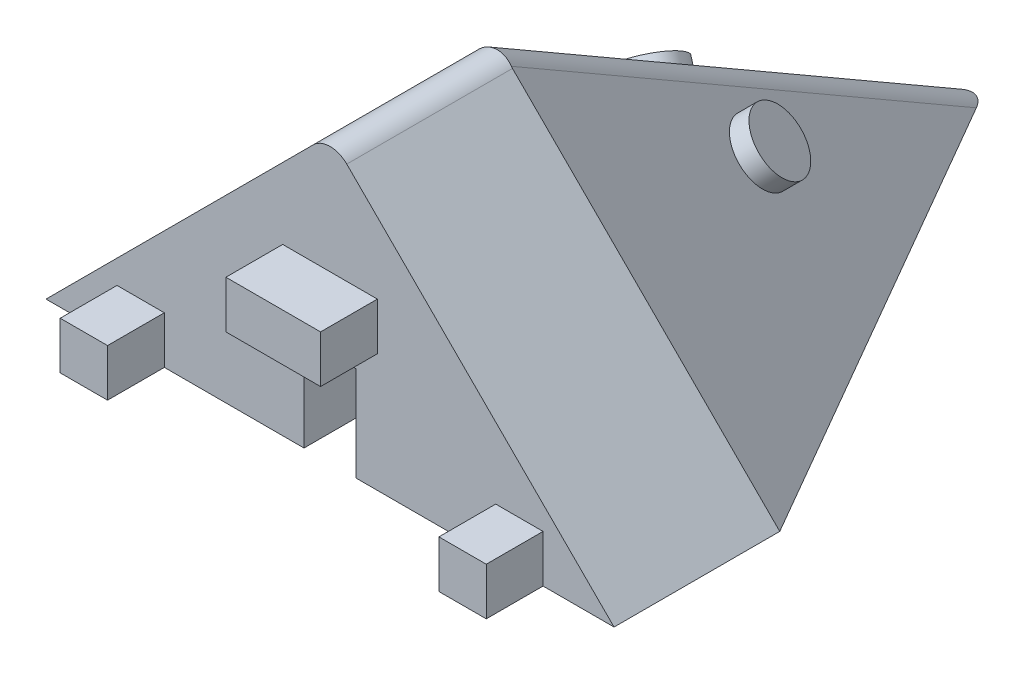
ISO-10303-21;
HEADER;
FILE_DESCRIPTION(('STEP AP214'),'2;1');
FILE_NAME('part.step','',(''),(''),'','','');
FILE_SCHEMA(('AUTOMOTIVE_DESIGN { 1 0 10303 214 1 1 1 1 }'));
ENDSEC;
DATA;
#1=APPLICATION_CONTEXT('core data for automotive mechanical design processes');
#2=APPLICATION_PROTOCOL_DEFINITION('international standard','automotive_design',2000,#1);
#3=PRODUCT_CONTEXT('',#1,'mechanical');
#4=PRODUCT('Part','Part','',(#3));
#5=PRODUCT_RELATED_PRODUCT_CATEGORY('part','',(#4));
#6=PRODUCT_DEFINITION_FORMATION('','',#4);
#7=PRODUCT_DEFINITION_CONTEXT('part definition',#1,'design');
#8=PRODUCT_DEFINITION('design','',#6,#7);
#9=PRODUCT_DEFINITION_SHAPE('','',#8);
#10=(LENGTH_UNIT() NAMED_UNIT(*) SI_UNIT(.MILLI.,.METRE.));
#11=(NAMED_UNIT(*) PLANE_ANGLE_UNIT() SI_UNIT($,.RADIAN.));
#12=(NAMED_UNIT(*) SI_UNIT($,.STERADIAN.) SOLID_ANGLE_UNIT());
#13=UNCERTAINTY_MEASURE_WITH_UNIT(LENGTH_MEASURE(1.E-05),#10,'distance_accuracy_value','');
#14=(GEOMETRIC_REPRESENTATION_CONTEXT(3) GLOBAL_UNCERTAINTY_ASSIGNED_CONTEXT((#13)) GLOBAL_UNIT_ASSIGNED_CONTEXT((#10,
#11,#12)) REPRESENTATION_CONTEXT('',''));
#15=CARTESIAN_POINT('',(0.,0.,0.));
#16=DIRECTION('',(0.,0.,1.));
#17=DIRECTION('',(1.,0.,0.));
#18=AXIS2_PLACEMENT_3D('',#15,#16,#17);
#19=CARTESIAN_POINT('',(0.,0.,17.5));
#20=DIRECTION('',(0.,0.,-1.));
#21=DIRECTION('',(-1.,0.,0.));
#22=AXIS2_PLACEMENT_3D('',#19,#20,#21);
#23=PLANE('',#22);
#24=DIRECTION('',(0.,-1.,0.));
#25=VECTOR('',#24,1.);
#26=CARTESIAN_POINT('',(-35.,17.5,17.5));
#27=LINE('',#26,#25);
#28=CARTESIAN_POINT('',(-35.,17.5,17.5));
#29=VERTEX_POINT('',#28);
#30=CARTESIAN_POINT('',(-35.,12.5,17.5));
#31=VERTEX_POINT('',#30);
#32=EDGE_CURVE('E259',#29,#31,#27,.T.);
#33=ORIENTED_EDGE('',*,*,#32,.F.);
#34=DIRECTION('',(-1.,0.,0.));
#35=VECTOR('',#34,1.);
#36=CARTESIAN_POINT('',(-35.,17.5,17.5));
#37=LINE('',#36,#35);
#38=CARTESIAN_POINT('',(-25.,17.5,17.5));
#39=VERTEX_POINT('',#38);
#40=EDGE_CURVE('E264',#39,#29,#37,.T.);
#41=ORIENTED_EDGE('',*,*,#40,.F.);
#42=DIRECTION('',(0.,1.,0.));
#43=VECTOR('',#42,1.);
#44=CARTESIAN_POINT('',(-25.,17.5,17.5));
#45=LINE('',#44,#43);
#46=CARTESIAN_POINT('',(-25.,12.5,17.5));
#47=VERTEX_POINT('',#46);
#48=EDGE_CURVE('E276',#47,#39,#45,.T.);
#49=ORIENTED_EDGE('',*,*,#48,.F.);
#50=DIRECTION('',(1.,0.,0.));
#51=VECTOR('',#50,1.);
#52=CARTESIAN_POINT('',(-35.,12.5,17.5));
#53=LINE('',#52,#51);
#54=EDGE_CURVE('E273',#31,#47,#53,.T.);
#55=ORIENTED_EDGE('',*,*,#54,.F.);
#56=EDGE_LOOP('',(#33,#41,#49,#55));
#57=FACE_BOUND('',#56,.T.);
#58=DIRECTION('',(-0.707106781186547,0.707106781186547,0.));
#59=VECTOR('',#58,1.);
#60=CARTESIAN_POINT('',(0.,0.,17.5));
#61=LINE('',#60,#59);
#62=CARTESIAN_POINT('',(0.,0.,17.5));
#63=VERTEX_POINT('',#62);
#64=CARTESIAN_POINT('',(-28.2322330470336,28.2322330470336,17.5));
#65=VERTEX_POINT('',#64);
#66=EDGE_CURVE('E307',#63,#65,#61,.T.);
#67=ORIENTED_EDGE('',*,*,#66,.T.);
#68=CARTESIAN_POINT('',(-30.,26.4644660940673,17.5));
#69=DIRECTION('',(0.,0.,-1.));
#70=DIRECTION('',(-1.,0.,0.));
#71=AXIS2_PLACEMENT_3D('',#68,#69,#70);
#72=CIRCLE('',#71,2.5);
#73=CARTESIAN_POINT('',(-31.7677669529664,28.2322330470336,17.5));
#74=VERTEX_POINT('',#73);
#75=EDGE_CURVE('E54',#65,#74,#72,.F.);
#76=ORIENTED_EDGE('',*,*,#75,.T.);
#77=DIRECTION('',(-0.707106781186547,-0.707106781186547,0.));
#78=VECTOR('',#77,1.);
#79=CARTESIAN_POINT('',(-30.,30.,17.5));
#80=LINE('',#79,#78);
#81=CARTESIAN_POINT('',(-60.,0.,17.5));
#82=VERTEX_POINT('',#81);
#83=EDGE_CURVE('E292',#74,#82,#80,.T.);
#84=ORIENTED_EDGE('',*,*,#83,.T.);
#85=DIRECTION('',(1.,0.,0.));
#86=VECTOR('',#85,1.);
#87=CARTESIAN_POINT('',(-60.,0.,17.5));
#88=LINE('',#87,#86);
#89=CARTESIAN_POINT('',(-52.5,0.,17.5));
#90=VERTEX_POINT('',#89);
#91=EDGE_CURVE('E295',#82,#90,#88,.T.);
#92=ORIENTED_EDGE('',*,*,#91,.T.);
#93=DIRECTION('',(0.,-1.,0.));
#94=VECTOR('',#93,1.);
#95=CARTESIAN_POINT('',(-52.5,0.,17.5));
#96=LINE('',#95,#94);
#97=CARTESIAN_POINT('',(-52.5,5.,17.5));
#98=VERTEX_POINT('',#97);
#99=EDGE_CURVE('E237',#98,#90,#96,.T.);
#100=ORIENTED_EDGE('',*,*,#99,.F.);
#101=DIRECTION('',(-1.,0.,0.));
#102=VECTOR('',#101,1.);
#103=CARTESIAN_POINT('',(-47.5,5.,17.5));
#104=LINE('',#103,#102);
#105=CARTESIAN_POINT('',(-47.5,5.,17.5));
#106=VERTEX_POINT('',#105);
#107=EDGE_CURVE('E227',#106,#98,#104,.T.);
#108=ORIENTED_EDGE('',*,*,#107,.F.);
#109=DIRECTION('',(0.,1.,0.));
#110=VECTOR('',#109,1.);
#111=CARTESIAN_POINT('',(-47.5,0.,17.5));
#112=LINE('',#111,#110);
#113=CARTESIAN_POINT('',(-47.5,0.,17.5));
#114=VERTEX_POINT('',#113);
#115=EDGE_CURVE('E224',#114,#106,#112,.T.);
#116=ORIENTED_EDGE('',*,*,#115,.F.);
#117=CARTESIAN_POINT('',(-32.75,0.,17.5));
#118=VERTEX_POINT('',#117);
#119=EDGE_CURVE('E294',#114,#118,#88,.T.);
#120=ORIENTED_EDGE('',*,*,#119,.T.);
#121=DIRECTION('',(0.,1.,0.));
#122=VECTOR('',#121,1.);
#123=CARTESIAN_POINT('',(-32.75,0.,17.5));
#124=LINE('',#123,#122);
#125=CARTESIAN_POINT('',(-32.75,10.,17.5));
#126=VERTEX_POINT('',#125);
#127=EDGE_CURVE('E297',#118,#126,#124,.T.);
#128=ORIENTED_EDGE('',*,*,#127,.T.);
#129=DIRECTION('',(1.,0.,0.));
#130=VECTOR('',#129,1.);
#131=CARTESIAN_POINT('',(-32.75,10.,17.5));
#132=LINE('',#131,#130);
#133=CARTESIAN_POINT('',(-27.25,10.,17.5));
#134=VERTEX_POINT('',#133);
#135=EDGE_CURVE('E299',#126,#134,#132,.T.);
#136=ORIENTED_EDGE('',*,*,#135,.T.);
#137=DIRECTION('',(0.,-1.,0.));
#138=VECTOR('',#137,1.);
#139=CARTESIAN_POINT('',(-27.25,10.,17.5));
#140=LINE('',#139,#138);
#141=CARTESIAN_POINT('',(-27.25,0.,17.5));
#142=VERTEX_POINT('',#141);
#143=EDGE_CURVE('E301',#134,#142,#140,.T.);
#144=ORIENTED_EDGE('',*,*,#143,.T.);
#145=DIRECTION('',(1.,0.,0.));
#146=VECTOR('',#145,1.);
#147=CARTESIAN_POINT('',(-27.25,0.,17.5));
#148=LINE('',#147,#146);
#149=CARTESIAN_POINT('',(-12.5,0.,17.5));
#150=VERTEX_POINT('',#149);
#151=EDGE_CURVE('E305',#142,#150,#148,.T.);
#152=ORIENTED_EDGE('',*,*,#151,.T.);
#153=DIRECTION('',(0.,-1.,0.));
#154=VECTOR('',#153,1.);
#155=CARTESIAN_POINT('',(-12.5,0.,17.5));
#156=LINE('',#155,#154);
#157=CARTESIAN_POINT('',(-12.5,5.,17.5));
#158=VERTEX_POINT('',#157);
#159=EDGE_CURVE('E223',#158,#150,#156,.T.);
#160=ORIENTED_EDGE('',*,*,#159,.F.);
#161=DIRECTION('',(-1.,0.,0.));
#162=VECTOR('',#161,1.);
#163=CARTESIAN_POINT('',(-12.5,5.,17.5));
#164=LINE('',#163,#162);
#165=CARTESIAN_POINT('',(-7.50000000000001,4.99999999999999,17.5));
#166=VERTEX_POINT('',#165);
#167=EDGE_CURVE('E220',#166,#158,#164,.T.);
#168=ORIENTED_EDGE('',*,*,#167,.F.);
#169=DIRECTION('',(0.,1.,0.));
#170=VECTOR('',#169,1.);
#171=CARTESIAN_POINT('',(-7.50000000000001,0.,17.5));
#172=LINE('',#171,#170);
#173=CARTESIAN_POINT('',(-7.50000000000001,0.,17.5));
#174=VERTEX_POINT('',#173);
#175=EDGE_CURVE('E555',#174,#166,#172,.T.);
#176=ORIENTED_EDGE('',*,*,#175,.F.);
#177=EDGE_CURVE('E304',#174,#63,#148,.T.);
#178=ORIENTED_EDGE('',*,*,#177,.T.);
#179=EDGE_LOOP('',(#67,#76,#84,#92,#100,#108,#116,#120,#128,#136,#144,#152,#160,#168,#176,#178));
#180=FACE_BOUND('',#179,.T.);
#181=ADVANCED_FACE('F44',(#57,#180),#23,.F.);
#182=CARTESIAN_POINT('',(0.,0.,0.));
#183=DIRECTION('',(0.,-1.,0.));
#184=DIRECTION('',(0.,0.,-1.));
#185=AXIS2_PLACEMENT_3D('',#182,#183,#184);
#186=PLANE('',#185);
#187=DIRECTION('',(-0.500000000000004,0.,0.866025403784436));
#188=VECTOR('',#187,1.);
#189=CARTESIAN_POINT('',(-60.,0.,0.));
#190=LINE('',#189,#188);
#191=CARTESIAN_POINT('',(-31.6366341767697,0.,-49.126790679497));
#192=VERTEX_POINT('',#191);
#193=CARTESIAN_POINT('',(-60.,0.,0.));
#194=VERTEX_POINT('',#193);
#195=EDGE_CURVE('E390',#192,#194,#190,.T.);
#196=ORIENTED_EDGE('',*,*,#195,.F.);
#197=CARTESIAN_POINT('',(-29.9999999999998,0.,-45.3471459494047));
#198=DIRECTION('',(0.,-1.,0.));
#199=DIRECTION('',(0.,0.,-1.));
#200=AXIS2_PLACEMENT_3D('',#197,#198,#199);
#201=ELLIPSE('',#200,5.,2.5);
#202=CARTESIAN_POINT('',(-28.3633658232298,0.,-49.126790679497));
#203=VERTEX_POINT('',#202);
#204=EDGE_CURVE('E12',#192,#203,#201,.T.);
#205=ORIENTED_EDGE('',*,*,#204,.T.);
#206=DIRECTION('',(-0.499999999999998,0.,-0.86602540378444));
#207=VECTOR('',#206,1.);
#208=CARTESIAN_POINT('',(-29.9999999999998,0.,-51.9615242270662));
#209=LINE('',#208,#207);
#210=CARTESIAN_POINT('',(0.,0.,0.));
#211=VERTEX_POINT('',#210);
#212=EDGE_CURVE('E335',#211,#203,#209,.T.);
#213=ORIENTED_EDGE('',*,*,#212,.F.);
#214=DIRECTION('',(0.,0.,-1.));
#215=VECTOR('',#214,1.);
#216=CARTESIAN_POINT('',(0.,0.,17.5));
#217=LINE('',#216,#215);
#218=EDGE_CURVE('E309',#63,#211,#217,.T.);
#219=ORIENTED_EDGE('',*,*,#218,.F.);
#220=ORIENTED_EDGE('',*,*,#177,.F.);
#221=DIRECTION('',(0.,0.,-1.));
#222=VECTOR('',#221,1.);
#223=CARTESIAN_POINT('',(-7.50000000000001,0.,23.5));
#224=LINE('',#223,#222);
#225=CARTESIAN_POINT('',(-7.50000000000001,0.,23.5));
#226=VERTEX_POINT('',#225);
#227=EDGE_CURVE('E207',#226,#174,#224,.T.);
#228=ORIENTED_EDGE('',*,*,#227,.F.);
#229=DIRECTION('',(1.,0.,0.));
#230=VECTOR('',#229,1.);
#231=CARTESIAN_POINT('',(-12.5,0.,23.5));
#232=LINE('',#231,#230);
#233=CARTESIAN_POINT('',(-12.5,0.,23.5));
#234=VERTEX_POINT('',#233);
#235=EDGE_CURVE('E198',#234,#226,#232,.T.);
#236=ORIENTED_EDGE('',*,*,#235,.F.);
#237=DIRECTION('',(0.,0.,-1.));
#238=VECTOR('',#237,1.);
#239=CARTESIAN_POINT('',(-12.5,0.,23.5));
#240=LINE('',#239,#238);
#241=EDGE_CURVE('E204',#234,#150,#240,.T.);
#242=ORIENTED_EDGE('',*,*,#241,.T.);
#243=ORIENTED_EDGE('',*,*,#151,.F.);
#244=DIRECTION('',(0.,0.,1.));
#245=VECTOR('',#244,1.);
#246=CARTESIAN_POINT('',(-27.25,0.,-10.));
#247=LINE('',#246,#245);
#248=CARTESIAN_POINT('',(-27.25,0.,-10.));
#249=VERTEX_POINT('',#248);
#250=EDGE_CURVE('E327',#249,#142,#247,.T.);
#251=ORIENTED_EDGE('',*,*,#250,.F.);
#252=DIRECTION('',(1.,0.,0.));
#253=VECTOR('',#252,1.);
#254=CARTESIAN_POINT('',(-32.75,0.,-10.));
#255=LINE('',#254,#253);
#256=CARTESIAN_POINT('',(-32.75,0.,-10.));
#257=VERTEX_POINT('',#256);
#258=EDGE_CURVE('E321',#257,#249,#255,.T.);
#259=ORIENTED_EDGE('',*,*,#258,.F.);
#260=DIRECTION('',(0.,0.,1.));
#261=VECTOR('',#260,1.);
#262=CARTESIAN_POINT('',(-32.75,0.,-10.));
#263=LINE('',#262,#261);
#264=EDGE_CURVE('E324',#257,#118,#263,.T.);
#265=ORIENTED_EDGE('',*,*,#264,.T.);
#266=ORIENTED_EDGE('',*,*,#119,.F.);
#267=DIRECTION('',(0.,0.,-1.));
#268=VECTOR('',#267,1.);
#269=CARTESIAN_POINT('',(-47.5,0.,23.5));
#270=LINE('',#269,#268);
#271=CARTESIAN_POINT('',(-47.5,0.,23.5));
#272=VERTEX_POINT('',#271);
#273=EDGE_CURVE('E242',#272,#114,#270,.T.);
#274=ORIENTED_EDGE('',*,*,#273,.F.);
#275=DIRECTION('',(1.,0.,0.));
#276=VECTOR('',#275,1.);
#277=CARTESIAN_POINT('',(-47.5,0.,23.5));
#278=LINE('',#277,#276);
#279=CARTESIAN_POINT('',(-52.5,0.,23.5));
#280=VERTEX_POINT('',#279);
#281=EDGE_CURVE('E241',#280,#272,#278,.T.);
#282=ORIENTED_EDGE('',*,*,#281,.F.);
#283=DIRECTION('',(0.,0.,-1.));
#284=VECTOR('',#283,1.);
#285=CARTESIAN_POINT('',(-52.5,0.,23.5));
#286=LINE('',#285,#284);
#287=EDGE_CURVE('E250',#280,#90,#286,.T.);
#288=ORIENTED_EDGE('',*,*,#287,.T.);
#289=ORIENTED_EDGE('',*,*,#91,.F.);
#290=DIRECTION('',(0.,0.,-1.));
#291=VECTOR('',#290,1.);
#292=CARTESIAN_POINT('',(-60.,0.,17.5));
#293=LINE('',#292,#291);
#294=EDGE_CURVE('E316',#82,#194,#293,.T.);
#295=ORIENTED_EDGE('',*,*,#294,.T.);
#296=EDGE_LOOP('',(#196,#205,#213,#219,#220,#228,#236,#242,#243,#251,#259,#265,#266,#274,#282,
#288,#289,#295));
#297=FACE_BOUND('',#296,.T.);
#298=ADVANCED_FACE('F201',(#297),#186,.T.);
#299=CARTESIAN_POINT('',(-29.9999999999998,0.,-51.9615242270662));
#300=DIRECTION('',(-0.654653670707977,0.654653670707975,-0.377964473009231));
#301=DIRECTION('',(-0.500000000000004,0.,0.866025403784436));
#302=AXIS2_PLACEMENT_3D('',#299,#300,#301);
#303=PLANE('',#302);
#304=CARTESIAN_POINT('',(-35.7286969133721,11.4450828740637,-22.2156650772278));
#305=DIRECTION('',(-0.654653670707977,0.654653670707975,-0.377964473009231));
#306=DIRECTION('',(-0.707106781186546,-0.707106781186549,0.));
#307=AXIS2_PLACEMENT_3D('',#304,#305,#306);
#308=CIRCLE('',#307,3.37523946651959);
#309=CARTESIAN_POINT('',(-38.1153516282766,9.05842815915926,-22.2156650772278));
#310=VERTEX_POINT('',#309);
#311=EDGE_CURVE('E387',#310,#310,#308,.T.);
#312=ORIENTED_EDGE('',*,*,#311,.F.);
#313=EDGE_LOOP('',(#312));
#314=FACE_BOUND('',#313,.T.);
#315=DIRECTION('',(-0.707106781186546,-0.707106781186549,0.));
#316=VECTOR('',#315,1.);
#317=CARTESIAN_POINT('',(-30.0000000000002,29.9999999999999,0.));
#318=LINE('',#317,#316);
#319=CARTESIAN_POINT('',(-31.7677669529664,28.2322330470337,0.));
#320=VERTEX_POINT('',#319);
#321=EDGE_CURVE('E380',#320,#194,#318,.T.);
#322=ORIENTED_EDGE('',*,*,#321,.F.);
#323=CARTESIAN_POINT('',(-30.,26.4644660940673,-6.12372435695808));
#324=DIRECTION('',(-0.654653670707977,0.654653670707975,-0.377964473009231));
#325=DIRECTION('',(0.267261241912428,-0.267261241912427,-0.92582009977255));
#326=AXIS2_PLACEMENT_3D('',#323,#324,#325);
#327=ELLIPSE('',#326,6.6143782776614,2.5);
#328=CARTESIAN_POINT('',(-31.6366341767702,28.3542884591132,-0.0157224558489932));
#329=VERTEX_POINT('',#328);
#330=EDGE_CURVE('E430',#320,#329,#327,.T.);
#331=ORIENTED_EDGE('',*,*,#330,.T.);
#332=DIRECTION('',(0.,-0.5,-0.866025403784439));
#333=VECTOR('',#332,1.);
#334=CARTESIAN_POINT('',(-31.6366341767697,-1.22747563257745,-51.2528408401739));
#335=LINE('',#334,#333);
#336=EDGE_CURVE('E386',#329,#192,#335,.T.);
#337=ORIENTED_EDGE('',*,*,#336,.T.);
#338=ORIENTED_EDGE('',*,*,#195,.T.);
#339=EDGE_LOOP('',(#322,#331,#337,#338));
#340=FACE_BOUND('',#339,.T.);
#341=ADVANCED_FACE('F344',(#314,#340),#303,.T.);
#342=CARTESIAN_POINT('',(0.,0.,0.));
#343=DIRECTION('',(0.654653670707974,0.654653670707982,-0.377964473009224));
#344=DIRECTION('',(-0.499999999999998,0.,-0.86602540378444));
#345=AXIS2_PLACEMENT_3D('',#342,#343,#344);
#346=PLANE('',#345);
#347=CARTESIAN_POINT('',(-24.2713030866278,11.4450828740637,-22.2156650772278));
#348=DIRECTION('',(0.654653670707975,0.654653670707982,-0.377964473009224));
#349=DIRECTION('',(-0.707106781186551,0.707106781186544,0.));
#350=AXIS2_PLACEMENT_3D('',#347,#348,#349);
#351=CIRCLE('',#350,3.37523946651959);
#352=CARTESIAN_POINT('',(-26.6579578015323,13.8317375889682,-22.2156650772278));
#353=VERTEX_POINT('',#352);
#354=EDGE_CURVE('E329',#353,#353,#351,.T.);
#355=ORIENTED_EDGE('',*,*,#354,.F.);
#356=EDGE_LOOP('',(#355));
#357=FACE_BOUND('',#356,.T.);
#358=DIRECTION('',(0.,-0.5,-0.866025403784439));
#359=VECTOR('',#358,1.);
#360=CARTESIAN_POINT('',(-28.3633658232302,21.2725243674224,-12.2816976698744));
#361=LINE('',#360,#359);
#362=CARTESIAN_POINT('',(-28.3633658232303,28.3542884591136,-0.0157224558483583));
#363=VERTEX_POINT('',#362);
#364=EDGE_CURVE('E70',#203,#363,#361,.F.);
#365=ORIENTED_EDGE('',*,*,#364,.T.);
#366=CARTESIAN_POINT('',(-30.,26.4644660940673,-6.12372435695746));
#367=DIRECTION('',(0.654653670707974,0.654653670707982,-0.377964473009224));
#368=DIRECTION('',(-0.26726124191242,-0.267261241912423,-0.925820099772553));
#369=AXIS2_PLACEMENT_3D('',#366,#367,#368);
#370=ELLIPSE('',#369,6.61437827766154,2.5);
#371=CARTESIAN_POINT('',(-28.2322330470337,28.2322330470336,0.));
#372=VERTEX_POINT('',#371);
#373=EDGE_CURVE('E423',#363,#372,#370,.T.);
#374=ORIENTED_EDGE('',*,*,#373,.T.);
#375=DIRECTION('',(-0.707106781186551,0.707106781186544,0.));
#376=VECTOR('',#375,1.);
#377=CARTESIAN_POINT('',(-30.0000000000002,29.9999999999999,0.));
#378=LINE('',#377,#376);
#379=EDGE_CURVE('E48',#211,#372,#378,.T.);
#380=ORIENTED_EDGE('',*,*,#379,.F.);
#381=ORIENTED_EDGE('',*,*,#212,.T.);
#382=EDGE_LOOP('',(#365,#374,#380,#381));
#383=FACE_BOUND('',#382,.T.);
#384=ADVANCED_FACE('F354',(#357,#383),#346,.T.);
#385=CARTESIAN_POINT('',(-22.9619957452119,12.7543902154797,-22.9715940232463));
#386=DIRECTION('',(-0.654653670707975,-0.654653670707982,0.377964473009224));
#387=DIRECTION('',(0.707106781186551,-0.707106781186544,0.));
#388=AXIS2_PLACEMENT_3D('',#385,#386,#387);
#389=CYLINDRICAL_SURFACE('',#388,3.37523946651959);
#390=CARTESIAN_POINT('',(-22.9619957452119,12.7543902154797,-22.9715940232463));
#391=DIRECTION('',(0.654653670707975,0.654653670707982,-0.377964473009224));
#392=DIRECTION('',(-0.707106781186551,0.707106781186544,0.));
#393=AXIS2_PLACEMENT_3D('',#390,#391,#392);
#394=CIRCLE('',#393,3.37523946651959);
#395=CARTESIAN_POINT('',(-25.3486504601164,15.1410449303842,-22.9715940232463));
#396=VERTEX_POINT('',#395);
#397=EDGE_CURVE('E332',#396,#396,#394,.T.);
#398=ORIENTED_EDGE('',*,*,#397,.F.);
#399=EDGE_LOOP('',(#398));
#400=FACE_BOUND('',#399,.T.);
#401=ORIENTED_EDGE('',*,*,#354,.T.);
#402=EDGE_LOOP('',(#401));
#403=FACE_BOUND('',#402,.T.);
#404=ADVANCED_FACE('F492',(#400,#403),#389,.T.);
#405=CARTESIAN_POINT('',(-22.9619957452119,12.7543902154797,-22.9715940232463));
#406=DIRECTION('',(0.654653670707975,0.654653670707982,-0.377964473009224));
#407=DIRECTION('',(-0.707106781186551,0.707106781186544,0.));
#408=AXIS2_PLACEMENT_3D('',#405,#406,#407);
#409=PLANE('',#408);
#410=ORIENTED_EDGE('',*,*,#397,.T.);
#411=EDGE_LOOP('',(#410));
#412=FACE_BOUND('',#411,.T.);
#413=ADVANCED_FACE('F489',(#412),#409,.T.);
#414=CARTESIAN_POINT('',(-32.75,0.,-10.));
#415=DIRECTION('',(-1.,0.,0.));
#416=DIRECTION('',(0.,0.,1.));
#417=AXIS2_PLACEMENT_3D('',#414,#415,#416);
#418=PLANE('',#417);
#419=ORIENTED_EDGE('',*,*,#264,.F.);
#420=CARTESIAN_POINT('',(-32.75,0.,0.));
#421=DIRECTION('',(-1.,0.,0.));
#422=DIRECTION('',(0.,0.,1.));
#423=AXIS2_PLACEMENT_3D('',#420,#421,#422);
#424=CIRCLE('',#423,10.);
#425=CARTESIAN_POINT('',(-32.75,10.,0.));
#426=VERTEX_POINT('',#425);
#427=EDGE_CURVE('E413',#257,#426,#424,.F.);
#428=ORIENTED_EDGE('',*,*,#427,.T.);
#429=DIRECTION('',(0.,0.,-1.));
#430=VECTOR('',#429,1.);
#431=CARTESIAN_POINT('',(-32.75,10.,17.5));
#432=LINE('',#431,#430);
#433=EDGE_CURVE('E313',#126,#426,#432,.T.);
#434=ORIENTED_EDGE('',*,*,#433,.F.);
#435=ORIENTED_EDGE('',*,*,#127,.F.);
#436=EDGE_LOOP('',(#419,#428,#434,#435));
#437=FACE_BOUND('',#436,.T.);
#438=ADVANCED_FACE('F485',(#437),#418,.F.);
#439=CARTESIAN_POINT('',(-27.25,0.,-10.));
#440=DIRECTION('',(1.,0.,0.));
#441=DIRECTION('',(0.,0.,-1.));
#442=AXIS2_PLACEMENT_3D('',#439,#440,#441);
#443=PLANE('',#442);
#444=ORIENTED_EDGE('',*,*,#250,.T.);
#445=ORIENTED_EDGE('',*,*,#143,.F.);
#446=DIRECTION('',(0.,0.,-1.));
#447=VECTOR('',#446,1.);
#448=CARTESIAN_POINT('',(-27.25,10.,17.5));
#449=LINE('',#448,#447);
#450=CARTESIAN_POINT('',(-27.25,10.,0.));
#451=VERTEX_POINT('',#450);
#452=EDGE_CURVE('E310',#134,#451,#449,.T.);
#453=ORIENTED_EDGE('',*,*,#452,.T.);
#454=CARTESIAN_POINT('',(-27.25,0.,0.));
#455=DIRECTION('',(1.,0.,0.));
#456=DIRECTION('',(0.,0.,-1.));
#457=AXIS2_PLACEMENT_3D('',#454,#455,#456);
#458=CIRCLE('',#457,10.);
#459=EDGE_CURVE('E536',#451,#249,#458,.F.);
#460=ORIENTED_EDGE('',*,*,#459,.T.);
#461=EDGE_LOOP('',(#444,#445,#453,#460));
#462=FACE_BOUND('',#461,.T.);
#463=ADVANCED_FACE('F482',(#462),#443,.F.);
#464=CARTESIAN_POINT('',(0.,0.,0.));
#465=DIRECTION('',(1.,0.,0.));
#466=DIRECTION('',(0.,0.,-1.));
#467=AXIS2_PLACEMENT_3D('',#464,#465,#466);
#468=CYLINDRICAL_SURFACE('',#467,10.);
#469=ORIENTED_EDGE('',*,*,#459,.F.);
#470=DIRECTION('',(-1.,0.,0.));
#471=VECTOR('',#470,1.);
#472=CARTESIAN_POINT('',(-32.75,10.,0.));
#473=LINE('',#472,#471);
#474=EDGE_CURVE('E320',#451,#426,#473,.T.);
#475=ORIENTED_EDGE('',*,*,#474,.T.);
#476=ORIENTED_EDGE('',*,*,#427,.F.);
#477=ORIENTED_EDGE('',*,*,#258,.T.);
#478=EDGE_LOOP('',(#469,#475,#476,#477));
#479=FACE_BOUND('',#478,.T.);
#480=ADVANCED_FACE('F480',(#479),#468,.F.);
#481=CARTESIAN_POINT('',(-37.0380042547881,12.7543902154797,-22.9715940232463));
#482=DIRECTION('',(0.654653670707975,-0.654653670707982,0.377964473009224));
#483=DIRECTION('',(0.707106781186551,0.707106781186544,0.));
#484=AXIS2_PLACEMENT_3D('',#481,#482,#483);
#485=CYLINDRICAL_SURFACE('',#484,3.37523946651959);
#486=CARTESIAN_POINT('',(-37.0380042547881,12.7543902154797,-22.9715940232463));
#487=DIRECTION('',(0.654653670707975,-0.654653670707982,0.377964473009224));
#488=DIRECTION('',(0.707106781186551,0.707106781186544,0.));
#489=AXIS2_PLACEMENT_3D('',#486,#487,#488);
#490=CIRCLE('',#489,3.37523946651959);
#491=CARTESIAN_POINT('',(-34.6513495398836,15.1410449303842,-22.9715940232463));
#492=VERTEX_POINT('',#491);
#493=EDGE_CURVE('E317',#492,#492,#490,.T.);
#494=ORIENTED_EDGE('',*,*,#493,.T.);
#495=EDGE_LOOP('',(#494));
#496=FACE_BOUND('',#495,.T.);
#497=ORIENTED_EDGE('',*,*,#311,.T.);
#498=EDGE_LOOP('',(#497));
#499=FACE_BOUND('',#498,.T.);
#500=ADVANCED_FACE('F476',(#496,#499),#485,.T.);
#501=CARTESIAN_POINT('',(-37.0380042547881,12.7543902154797,-22.9715940232463));
#502=DIRECTION('',(-0.654653670707975,0.654653670707982,-0.377964473009224));
#503=DIRECTION('',(0.707106781186551,0.707106781186544,0.));
#504=AXIS2_PLACEMENT_3D('',#501,#502,#503);
#505=PLANE('',#504);
#506=ORIENTED_EDGE('',*,*,#493,.F.);
#507=EDGE_LOOP('',(#506));
#508=FACE_BOUND('',#507,.T.);
#509=ADVANCED_FACE('F472',(#508),#505,.T.);
#510=CARTESIAN_POINT('',(-30.,30.,17.5));
#511=DIRECTION('',(0.707106781186548,-0.707106781186548,0.));
#512=DIRECTION('',(0.707106781186548,0.707106781186548,0.));
#513=AXIS2_PLACEMENT_3D('',#510,#511,#512);
#514=PLANE('',#513);
#515=ORIENTED_EDGE('',*,*,#83,.F.);
#516=DIRECTION('',(0.,0.,-1.));
#517=VECTOR('',#516,1.);
#518=CARTESIAN_POINT('',(-31.7677669529664,28.2322330470336,17.5));
#519=LINE('',#518,#517);
#520=EDGE_CURVE('E383',#74,#320,#519,.T.);
#521=ORIENTED_EDGE('',*,*,#520,.T.);
#522=ORIENTED_EDGE('',*,*,#321,.T.);
#523=ORIENTED_EDGE('',*,*,#294,.F.);
#524=EDGE_LOOP('',(#515,#521,#522,#523));
#525=FACE_BOUND('',#524,.T.);
#526=ADVANCED_FACE('F467',(#525),#514,.F.);
#527=CARTESIAN_POINT('',(-32.75,10.,17.5));
#528=DIRECTION('',(0.,1.,0.));
#529=DIRECTION('',(0.,0.,1.));
#530=AXIS2_PLACEMENT_3D('',#527,#528,#529);
#531=PLANE('',#530);
#532=ORIENTED_EDGE('',*,*,#474,.F.);
#533=ORIENTED_EDGE('',*,*,#452,.F.);
#534=ORIENTED_EDGE('',*,*,#135,.F.);
#535=ORIENTED_EDGE('',*,*,#433,.T.);
#536=EDGE_LOOP('',(#532,#533,#534,#535));
#537=FACE_BOUND('',#536,.T.);
#538=ADVANCED_FACE('F464',(#537),#531,.F.);
#539=CARTESIAN_POINT('',(0.,0.,17.5));
#540=DIRECTION('',(-0.707106781186548,-0.707106781186548,0.));
#541=DIRECTION('',(0.707106781186548,-0.707106781186548,0.));
#542=AXIS2_PLACEMENT_3D('',#539,#540,#541);
#543=PLANE('',#542);
#544=ORIENTED_EDGE('',*,*,#379,.T.);
#545=DIRECTION('',(0.,0.,-1.));
#546=VECTOR('',#545,1.);
#547=CARTESIAN_POINT('',(-28.2322330470336,28.2322330470336,17.5));
#548=LINE('',#547,#546);
#549=EDGE_CURVE('E62',#372,#65,#548,.F.);
#550=ORIENTED_EDGE('',*,*,#549,.T.);
#551=ORIENTED_EDGE('',*,*,#66,.F.);
#552=ORIENTED_EDGE('',*,*,#218,.T.);
#553=EDGE_LOOP('',(#544,#550,#551,#552));
#554=FACE_BOUND('',#553,.T.);
#555=ADVANCED_FACE('F443',(#554),#543,.F.);
#556=CARTESIAN_POINT('',(-35.,17.5,23.5));
#557=DIRECTION('',(1.,0.,0.));
#558=DIRECTION('',(0.,0.,-1.));
#559=AXIS2_PLACEMENT_3D('',#556,#557,#558);
#560=PLANE('',#559);
#561=ORIENTED_EDGE('',*,*,#32,.T.);
#562=DIRECTION('',(0.,0.,-1.));
#563=VECTOR('',#562,1.);
#564=CARTESIAN_POINT('',(-35.,12.5,23.5));
#565=LINE('',#564,#563);
#566=CARTESIAN_POINT('',(-35.,12.5,23.5));
#567=VERTEX_POINT('',#566);
#568=EDGE_CURVE('E289',#567,#31,#565,.T.);
#569=ORIENTED_EDGE('',*,*,#568,.F.);
#570=DIRECTION('',(0.,-1.,0.));
#571=VECTOR('',#570,1.);
#572=CARTESIAN_POINT('',(-35.,17.5,23.5));
#573=LINE('',#572,#571);
#574=CARTESIAN_POINT('',(-35.,17.5,23.5));
#575=VERTEX_POINT('',#574);
#576=EDGE_CURVE('E260',#575,#567,#573,.T.);
#577=ORIENTED_EDGE('',*,*,#576,.F.);
#578=DIRECTION('',(0.,0.,-1.));
#579=VECTOR('',#578,1.);
#580=CARTESIAN_POINT('',(-35.,17.5,23.5));
#581=LINE('',#580,#579);
#582=EDGE_CURVE('E270',#575,#29,#581,.T.);
#583=ORIENTED_EDGE('',*,*,#582,.T.);
#584=EDGE_LOOP('',(#561,#569,#577,#583));
#585=FACE_BOUND('',#584,.T.);
#586=ADVANCED_FACE('F463',(#585),#560,.F.);
#587=CARTESIAN_POINT('',(-35.,12.5,23.5));
#588=DIRECTION('',(0.,1.,0.));
#589=DIRECTION('',(0.,0.,1.));
#590=AXIS2_PLACEMENT_3D('',#587,#588,#589);
#591=PLANE('',#590);
#592=ORIENTED_EDGE('',*,*,#54,.T.);
#593=DIRECTION('',(0.,0.,-1.));
#594=VECTOR('',#593,1.);
#595=CARTESIAN_POINT('',(-25.,12.5,23.5));
#596=LINE('',#595,#594);
#597=CARTESIAN_POINT('',(-25.,12.5,23.5));
#598=VERTEX_POINT('',#597);
#599=EDGE_CURVE('E286',#598,#47,#596,.T.);
#600=ORIENTED_EDGE('',*,*,#599,.F.);
#601=DIRECTION('',(1.,0.,0.));
#602=VECTOR('',#601,1.);
#603=CARTESIAN_POINT('',(-35.,12.5,23.5));
#604=LINE('',#603,#602);
#605=EDGE_CURVE('E263',#567,#598,#604,.T.);
#606=ORIENTED_EDGE('',*,*,#605,.F.);
#607=ORIENTED_EDGE('',*,*,#568,.T.);
#608=EDGE_LOOP('',(#592,#600,#606,#607));
#609=FACE_BOUND('',#608,.T.);
#610=ADVANCED_FACE('F602',(#609),#591,.F.);
#611=CARTESIAN_POINT('',(-25.,17.5,23.5));
#612=DIRECTION('',(-1.,0.,0.));
#613=DIRECTION('',(0.,-1.,0.));
#614=AXIS2_PLACEMENT_3D('',#611,#612,#613);
#615=PLANE('',#614);
#616=ORIENTED_EDGE('',*,*,#48,.T.);
#617=DIRECTION('',(0.,0.,-1.));
#618=VECTOR('',#617,1.);
#619=CARTESIAN_POINT('',(-25.,17.5,23.5));
#620=LINE('',#619,#618);
#621=CARTESIAN_POINT('',(-25.,17.5,23.5));
#622=VERTEX_POINT('',#621);
#623=EDGE_CURVE('E283',#622,#39,#620,.T.);
#624=ORIENTED_EDGE('',*,*,#623,.F.);
#625=DIRECTION('',(0.,1.,0.));
#626=VECTOR('',#625,1.);
#627=CARTESIAN_POINT('',(-25.,17.5,23.5));
#628=LINE('',#627,#626);
#629=EDGE_CURVE('E266',#598,#622,#628,.T.);
#630=ORIENTED_EDGE('',*,*,#629,.F.);
#631=ORIENTED_EDGE('',*,*,#599,.T.);
#632=EDGE_LOOP('',(#616,#624,#630,#631));
#633=FACE_BOUND('',#632,.T.);
#634=ADVANCED_FACE('F598',(#633),#615,.F.);
#635=CARTESIAN_POINT('',(-35.,17.5,23.5));
#636=DIRECTION('',(0.,-1.,0.));
#637=DIRECTION('',(0.,0.,-1.));
#638=AXIS2_PLACEMENT_3D('',#635,#636,#637);
#639=PLANE('',#638);
#640=ORIENTED_EDGE('',*,*,#40,.T.);
#641=ORIENTED_EDGE('',*,*,#582,.F.);
#642=DIRECTION('',(-1.,0.,0.));
#643=VECTOR('',#642,1.);
#644=CARTESIAN_POINT('',(-35.,17.5,23.5));
#645=LINE('',#644,#643);
#646=EDGE_CURVE('E268',#622,#575,#645,.T.);
#647=ORIENTED_EDGE('',*,*,#646,.F.);
#648=ORIENTED_EDGE('',*,*,#623,.T.);
#649=EDGE_LOOP('',(#640,#641,#647,#648));
#650=FACE_BOUND('',#649,.T.);
#651=ADVANCED_FACE('F594',(#650),#639,.F.);
#652=CARTESIAN_POINT('',(0.,0.,23.5));
#653=DIRECTION('',(0.,0.,1.));
#654=DIRECTION('',(1.,0.,0.));
#655=AXIS2_PLACEMENT_3D('',#652,#653,#654);
#656=PLANE('',#655);
#657=ORIENTED_EDGE('',*,*,#576,.T.);
#658=ORIENTED_EDGE('',*,*,#605,.T.);
#659=ORIENTED_EDGE('',*,*,#629,.T.);
#660=ORIENTED_EDGE('',*,*,#646,.T.);
#661=EDGE_LOOP('',(#657,#658,#659,#660));
#662=FACE_BOUND('',#661,.T.);
#663=ADVANCED_FACE('F591',(#662),#656,.T.);
#664=CARTESIAN_POINT('',(-47.5,0.,23.5));
#665=DIRECTION('',(-1.,0.,0.));
#666=DIRECTION('',(0.,0.,1.));
#667=AXIS2_PLACEMENT_3D('',#664,#665,#666);
#668=PLANE('',#667);
#669=ORIENTED_EDGE('',*,*,#115,.T.);
#670=DIRECTION('',(0.,0.,-1.));
#671=VECTOR('',#670,1.);
#672=CARTESIAN_POINT('',(-47.5,5.,23.5));
#673=LINE('',#672,#671);
#674=CARTESIAN_POINT('',(-47.5,5.,23.5));
#675=VERTEX_POINT('',#674);
#676=EDGE_CURVE('E256',#675,#106,#673,.T.);
#677=ORIENTED_EDGE('',*,*,#676,.F.);
#678=DIRECTION('',(0.,1.,0.));
#679=VECTOR('',#678,1.);
#680=CARTESIAN_POINT('',(-47.5,0.,23.5));
#681=LINE('',#680,#679);
#682=EDGE_CURVE('E233',#272,#675,#681,.T.);
#683=ORIENTED_EDGE('',*,*,#682,.F.);
#684=ORIENTED_EDGE('',*,*,#273,.T.);
#685=EDGE_LOOP('',(#669,#677,#683,#684));
#686=FACE_BOUND('',#685,.T.);
#687=ADVANCED_FACE('F525',(#686),#668,.F.);
#688=CARTESIAN_POINT('',(-47.5,5.,23.5));
#689=DIRECTION('',(0.,-1.,0.));
#690=DIRECTION('',(1.,0.,0.));
#691=AXIS2_PLACEMENT_3D('',#688,#689,#690);
#692=PLANE('',#691);
#693=ORIENTED_EDGE('',*,*,#107,.T.);
#694=DIRECTION('',(0.,0.,-1.));
#695=VECTOR('',#694,1.);
#696=CARTESIAN_POINT('',(-52.5,5.,23.5));
#697=LINE('',#696,#695);
#698=CARTESIAN_POINT('',(-52.5,5.,23.5));
#699=VERTEX_POINT('',#698);
#700=EDGE_CURVE('E253',#699,#98,#697,.T.);
#701=ORIENTED_EDGE('',*,*,#700,.F.);
#702=DIRECTION('',(-1.,0.,0.));
#703=VECTOR('',#702,1.);
#704=CARTESIAN_POINT('',(-47.5,5.,23.5));
#705=LINE('',#704,#703);
#706=EDGE_CURVE('E236',#675,#699,#705,.T.);
#707=ORIENTED_EDGE('',*,*,#706,.F.);
#708=ORIENTED_EDGE('',*,*,#676,.T.);
#709=EDGE_LOOP('',(#693,#701,#707,#708));
#710=FACE_BOUND('',#709,.T.);
#711=ADVANCED_FACE('F521',(#710),#692,.F.);
#712=CARTESIAN_POINT('',(-52.5,0.,23.5));
#713=DIRECTION('',(1.,0.,0.));
#714=DIRECTION('',(0.,0.,-1.));
#715=AXIS2_PLACEMENT_3D('',#712,#713,#714);
#716=PLANE('',#715);
#717=ORIENTED_EDGE('',*,*,#99,.T.);
#718=ORIENTED_EDGE('',*,*,#287,.F.);
#719=DIRECTION('',(0.,-1.,0.));
#720=VECTOR('',#719,1.);
#721=CARTESIAN_POINT('',(-52.5,0.,23.5));
#722=LINE('',#721,#720);
#723=EDGE_CURVE('E239',#699,#280,#722,.T.);
#724=ORIENTED_EDGE('',*,*,#723,.F.);
#725=ORIENTED_EDGE('',*,*,#700,.T.);
#726=EDGE_LOOP('',(#717,#718,#724,#725));
#727=FACE_BOUND('',#726,.T.);
#728=ADVANCED_FACE('F517',(#727),#716,.F.);
#729=CARTESIAN_POINT('',(0.,0.,23.5));
#730=DIRECTION('',(0.,0.,1.));
#731=DIRECTION('',(1.,0.,0.));
#732=AXIS2_PLACEMENT_3D('',#729,#730,#731);
#733=PLANE('',#732);
#734=ORIENTED_EDGE('',*,*,#682,.T.);
#735=ORIENTED_EDGE('',*,*,#706,.T.);
#736=ORIENTED_EDGE('',*,*,#723,.T.);
#737=ORIENTED_EDGE('',*,*,#281,.T.);
#738=EDGE_LOOP('',(#734,#735,#736,#737));
#739=FACE_BOUND('',#738,.T.);
#740=ADVANCED_FACE('F581',(#739),#733,.T.);
#741=CARTESIAN_POINT('',(-12.5,0.,23.5));
#742=DIRECTION('',(1.,0.,0.));
#743=DIRECTION('',(0.,0.,-1.));
#744=AXIS2_PLACEMENT_3D('',#741,#742,#743);
#745=PLANE('',#744);
#746=ORIENTED_EDGE('',*,*,#159,.T.);
#747=ORIENTED_EDGE('',*,*,#241,.F.);
#748=DIRECTION('',(0.,-1.,0.));
#749=VECTOR('',#748,1.);
#750=CARTESIAN_POINT('',(-12.5,0.,23.5));
#751=LINE('',#750,#749);
#752=CARTESIAN_POINT('',(-12.5,5.,23.5));
#753=VERTEX_POINT('',#752);
#754=EDGE_CURVE('E211',#753,#234,#751,.T.);
#755=ORIENTED_EDGE('',*,*,#754,.F.);
#756=DIRECTION('',(0.,0.,-1.));
#757=VECTOR('',#756,1.);
#758=CARTESIAN_POINT('',(-12.5,5.,23.5));
#759=LINE('',#758,#757);
#760=EDGE_CURVE('E563',#753,#158,#759,.T.);
#761=ORIENTED_EDGE('',*,*,#760,.T.);
#762=EDGE_LOOP('',(#746,#747,#755,#761));
#763=FACE_BOUND('',#762,.T.);
#764=ADVANCED_FACE('F222',(#763),#745,.F.);
#765=CARTESIAN_POINT('',(-7.50000000000001,0.,23.5));
#766=DIRECTION('',(-1.,0.,0.));
#767=DIRECTION('',(0.,0.,1.));
#768=AXIS2_PLACEMENT_3D('',#765,#766,#767);
#769=PLANE('',#768);
#770=ORIENTED_EDGE('',*,*,#175,.T.);
#771=DIRECTION('',(0.,0.,-1.));
#772=VECTOR('',#771,1.);
#773=CARTESIAN_POINT('',(-7.50000000000001,4.99999999999999,23.5));
#774=LINE('',#773,#772);
#775=CARTESIAN_POINT('',(-7.50000000000001,4.99999999999999,23.5));
#776=VERTEX_POINT('',#775);
#777=EDGE_CURVE('E229',#776,#166,#774,.T.);
#778=ORIENTED_EDGE('',*,*,#777,.F.);
#779=DIRECTION('',(0.,1.,0.));
#780=VECTOR('',#779,1.);
#781=CARTESIAN_POINT('',(-7.50000000000001,0.,23.5));
#782=LINE('',#781,#780);
#783=EDGE_CURVE('E210',#226,#776,#782,.T.);
#784=ORIENTED_EDGE('',*,*,#783,.F.);
#785=ORIENTED_EDGE('',*,*,#227,.T.);
#786=EDGE_LOOP('',(#770,#778,#784,#785));
#787=FACE_BOUND('',#786,.T.);
#788=ADVANCED_FACE('F561',(#787),#769,.F.);
#789=CARTESIAN_POINT('',(-12.5,5.,23.5));
#790=DIRECTION('',(0.,-1.,0.));
#791=DIRECTION('',(1.,0.,0.));
#792=AXIS2_PLACEMENT_3D('',#789,#790,#791);
#793=PLANE('',#792);
#794=ORIENTED_EDGE('',*,*,#167,.T.);
#795=ORIENTED_EDGE('',*,*,#760,.F.);
#796=DIRECTION('',(-1.,0.,0.));
#797=VECTOR('',#796,1.);
#798=CARTESIAN_POINT('',(-12.5,5.,23.5));
#799=LINE('',#798,#797);
#800=EDGE_CURVE('E216',#776,#753,#799,.T.);
#801=ORIENTED_EDGE('',*,*,#800,.F.);
#802=ORIENTED_EDGE('',*,*,#777,.T.);
#803=EDGE_LOOP('',(#794,#795,#801,#802));
#804=FACE_BOUND('',#803,.T.);
#805=ADVANCED_FACE('F569',(#804),#793,.F.);
#806=CARTESIAN_POINT('',(0.,0.,23.5));
#807=DIRECTION('',(0.,0.,-1.));
#808=DIRECTION('',(-1.,0.,0.));
#809=AXIS2_PLACEMENT_3D('',#806,#807,#808);
#810=PLANE('',#809);
#811=ORIENTED_EDGE('',*,*,#754,.T.);
#812=ORIENTED_EDGE('',*,*,#235,.T.);
#813=ORIENTED_EDGE('',*,*,#783,.T.);
#814=ORIENTED_EDGE('',*,*,#800,.T.);
#815=EDGE_LOOP('',(#811,#812,#813,#814));
#816=FACE_BOUND('',#815,.T.);
#817=ADVANCED_FACE('F214',(#816),#810,.F.);
#818=CARTESIAN_POINT('',(-29.9999999999998,-2.86410980934739,-50.3079296576508));
#819=DIRECTION('',(0.,-0.5,-0.866025403784439));
#820=DIRECTION('',(0.,0.866025403784439,-0.5));
#821=AXIS2_PLACEMENT_3D('',#818,#819,#820);
#822=CYLINDRICAL_SURFACE('',#821,2.5);
#823=ORIENTED_EDGE('',*,*,#204,.F.);
#824=ORIENTED_EDGE('',*,*,#336,.F.);
#825=CARTESIAN_POINT('',(-30.0000000000001,26.4644660940673,0.490653920703715));
#826=DIRECTION('',(0.,-0.258819045102521,-0.965925826289068));
#827=DIRECTION('',(0.,-0.965925826289068,0.258819045102521));
#828=AXIS2_PLACEMENT_3D('',#825,#826,#827);
#829=ELLIPSE('',#828,2.58819045102521,2.5);
#830=EDGE_CURVE('E414',#363,#329,#829,.F.);
#831=ORIENTED_EDGE('',*,*,#830,.F.);
#832=ORIENTED_EDGE('',*,*,#364,.F.);
#833=EDGE_LOOP('',(#823,#824,#831,#832));
#834=FACE_BOUND('',#833,.T.);
#835=ADVANCED_FACE('F46',(#834),#822,.T.);
#836=CARTESIAN_POINT('',(-30.,26.4644660940673,17.5));
#837=DIRECTION('',(0.,0.,-1.));
#838=DIRECTION('',(-1.,0.,0.));
#839=AXIS2_PLACEMENT_3D('',#836,#837,#838);
#840=CYLINDRICAL_SURFACE('',#839,2.5);
#841=ORIENTED_EDGE('',*,*,#75,.F.);
#842=ORIENTED_EDGE('',*,*,#549,.F.);
#843=ORIENTED_EDGE('',*,*,#373,.F.);
#844=ORIENTED_EDGE('',*,*,#830,.T.);
#845=ORIENTED_EDGE('',*,*,#330,.F.);
#846=ORIENTED_EDGE('',*,*,#520,.F.);
#847=EDGE_LOOP('',(#841,#842,#843,#844,#845,#846));
#848=FACE_BOUND('',#847,.T.);
#849=ADVANCED_FACE('F439',(#848),#840,.T.);
#850=CLOSED_SHELL('',(#181,#298,#341,#384,#404,#413,#438,#463,#480,#500,#509,#526,#538,#555,
#586,#610,#634,#651,#663,#687,#711,#728,#740,#764,#788,#805,#817,#835,#849));
#851=MANIFOLD_SOLID_BREP('B2',#850);
#852=ADVANCED_BREP_SHAPE_REPRESENTATION('',(#18,#851),#14);
#853=SHAPE_DEFINITION_REPRESENTATION(#9,#852);
ENDSEC;
END-ISO-10303-21;
